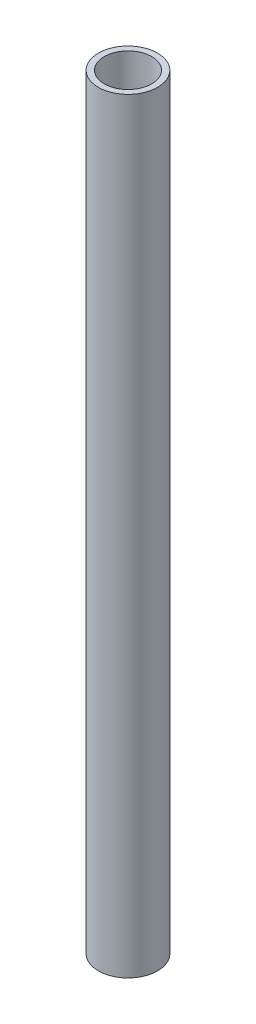
ISO-10303-21;
HEADER;
FILE_DESCRIPTION(('STEP AP214'),'2;1');
FILE_NAME('part.step','',(''),(''),'','','');
FILE_SCHEMA(('AUTOMOTIVE_DESIGN { 1 0 10303 214 1 1 1 1 }'));
ENDSEC;
DATA;
#1=APPLICATION_CONTEXT('core data for automotive mechanical design processes');
#2=APPLICATION_PROTOCOL_DEFINITION('international standard','automotive_design',2000,#1);
#3=PRODUCT_CONTEXT('',#1,'mechanical');
#4=PRODUCT('Part','Part','',(#3));
#5=PRODUCT_RELATED_PRODUCT_CATEGORY('part','',(#4));
#6=PRODUCT_DEFINITION_FORMATION('','',#4);
#7=PRODUCT_DEFINITION_CONTEXT('part definition',#1,'design');
#8=PRODUCT_DEFINITION('design','',#6,#7);
#9=PRODUCT_DEFINITION_SHAPE('','',#8);
#10=(LENGTH_UNIT() NAMED_UNIT(*) SI_UNIT(.MILLI.,.METRE.));
#11=(NAMED_UNIT(*) PLANE_ANGLE_UNIT() SI_UNIT($,.RADIAN.));
#12=(NAMED_UNIT(*) SI_UNIT($,.STERADIAN.) SOLID_ANGLE_UNIT());
#13=UNCERTAINTY_MEASURE_WITH_UNIT(LENGTH_MEASURE(1.E-05),#10,'distance_accuracy_value','');
#14=(GEOMETRIC_REPRESENTATION_CONTEXT(3) GLOBAL_UNCERTAINTY_ASSIGNED_CONTEXT((#13)) GLOBAL_UNIT_ASSIGNED_CONTEXT((#10,
#11,#12)) REPRESENTATION_CONTEXT('',''));
#15=CARTESIAN_POINT('',(0.,0.,0.));
#16=DIRECTION('',(0.,0.,1.));
#17=DIRECTION('',(1.,0.,0.));
#18=AXIS2_PLACEMENT_3D('',#15,#16,#17);
#19=CARTESIAN_POINT('',(0.,205.,0.));
#20=DIRECTION('',(0.,1.,0.));
#21=DIRECTION('',(0.,0.,1.));
#22=AXIS2_PLACEMENT_3D('',#19,#20,#21);
#23=PLANE('',#22);
#24=CARTESIAN_POINT('',(0.,205.,0.));
#25=DIRECTION('',(0.,1.,0.));
#26=DIRECTION('',(0.,0.,1.));
#27=AXIS2_PLACEMENT_3D('',#24,#25,#26);
#28=CIRCLE('',#27,7.9375);
#29=CARTESIAN_POINT('',(0.,205.,7.93750000000001));
#30=VERTEX_POINT('',#29);
#31=EDGE_CURVE('E12',#30,#30,#28,.T.);
#32=ORIENTED_EDGE('',*,*,#31,.T.);
#33=EDGE_LOOP('',(#32));
#34=FACE_BOUND('',#33,.T.);
#35=CARTESIAN_POINT('',(0.,205.,0.));
#36=DIRECTION('',(0.,1.,0.));
#37=DIRECTION('',(0.,0.,1.));
#38=AXIS2_PLACEMENT_3D('',#35,#36,#37);
#39=CIRCLE('',#38,6.35);
#40=CARTESIAN_POINT('',(0.,205.,6.35000000000001));
#41=VERTEX_POINT('',#40);
#42=EDGE_CURVE('E51',#41,#41,#39,.T.);
#43=ORIENTED_EDGE('',*,*,#42,.F.);
#44=EDGE_LOOP('',(#43));
#45=FACE_BOUND('',#44,.T.);
#46=ADVANCED_FACE('F40',(#34,#45),#23,.T.);
#47=CARTESIAN_POINT('',(0.,0.,0.));
#48=DIRECTION('',(0.,1.,0.));
#49=DIRECTION('',(0.,0.,1.));
#50=AXIS2_PLACEMENT_3D('',#47,#48,#49);
#51=PLANE('',#50);
#52=CARTESIAN_POINT('',(0.,0.,0.));
#53=DIRECTION('',(0.,1.,0.));
#54=DIRECTION('',(0.,0.,1.));
#55=AXIS2_PLACEMENT_3D('',#52,#53,#54);
#56=CIRCLE('',#55,7.9375);
#57=CARTESIAN_POINT('',(0.,0.,7.93750000000001));
#58=VERTEX_POINT('',#57);
#59=EDGE_CURVE('E44',#58,#58,#56,.T.);
#60=ORIENTED_EDGE('',*,*,#59,.F.);
#61=EDGE_LOOP('',(#60));
#62=FACE_BOUND('',#61,.T.);
#63=CARTESIAN_POINT('',(0.,0.,0.));
#64=DIRECTION('',(0.,1.,0.));
#65=DIRECTION('',(0.,0.,1.));
#66=AXIS2_PLACEMENT_3D('',#63,#64,#65);
#67=CIRCLE('',#66,6.35);
#68=CARTESIAN_POINT('',(0.,0.,6.35000000000001));
#69=VERTEX_POINT('',#68);
#70=EDGE_CURVE('E53',#69,#69,#67,.T.);
#71=ORIENTED_EDGE('',*,*,#70,.T.);
#72=EDGE_LOOP('',(#71));
#73=FACE_BOUND('',#72,.T.);
#74=ADVANCED_FACE('F63',(#62,#73),#51,.F.);
#75=CARTESIAN_POINT('',(0.,205.,0.));
#76=DIRECTION('',(0.,-1.,0.));
#77=DIRECTION('',(0.,0.,-1.));
#78=AXIS2_PLACEMENT_3D('',#75,#76,#77);
#79=CYLINDRICAL_SURFACE('',#78,7.9375);
#80=ORIENTED_EDGE('',*,*,#31,.F.);
#81=EDGE_LOOP('',(#80));
#82=FACE_BOUND('',#81,.T.);
#83=ORIENTED_EDGE('',*,*,#59,.T.);
#84=EDGE_LOOP('',(#83));
#85=FACE_BOUND('',#84,.T.);
#86=ADVANCED_FACE('F42',(#82,#85),#79,.T.);
#87=CARTESIAN_POINT('',(0.,205.,0.));
#88=DIRECTION('',(0.,-1.,0.));
#89=DIRECTION('',(0.,0.,-1.));
#90=AXIS2_PLACEMENT_3D('',#87,#88,#89);
#91=CYLINDRICAL_SURFACE('',#90,6.35);
#92=ORIENTED_EDGE('',*,*,#42,.T.);
#93=EDGE_LOOP('',(#92));
#94=FACE_BOUND('',#93,.T.);
#95=ORIENTED_EDGE('',*,*,#70,.F.);
#96=EDGE_LOOP('',(#95));
#97=FACE_BOUND('',#96,.T.);
#98=ADVANCED_FACE('F59',(#94,#97),#91,.F.);
#99=CLOSED_SHELL('',(#46,#74,#86,#98));
#100=MANIFOLD_SOLID_BREP('B2',#99);
#101=ADVANCED_BREP_SHAPE_REPRESENTATION('',(#18,#100),#14);
#102=SHAPE_DEFINITION_REPRESENTATION(#9,#101);
ENDSEC;
END-ISO-10303-21;
